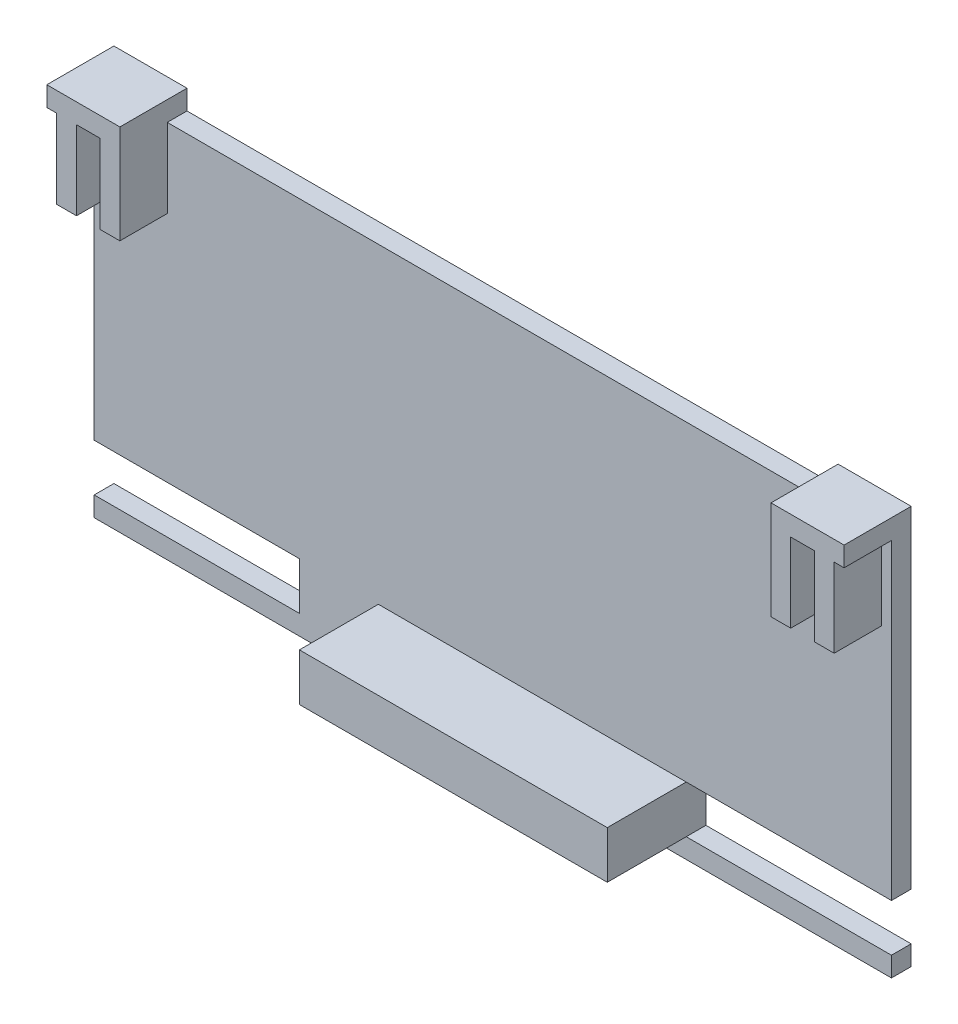
ISO-10303-21;
HEADER;
FILE_DESCRIPTION(('STEP AP214'),'2;1');
FILE_NAME('part.step','',(''),(''),'','','');
FILE_SCHEMA(('AUTOMOTIVE_DESIGN { 1 0 10303 214 1 1 1 1 }'));
ENDSEC;
DATA;
#1=APPLICATION_CONTEXT('core data for automotive mechanical design processes');
#2=APPLICATION_PROTOCOL_DEFINITION('international standard','automotive_design',2000,#1);
#3=PRODUCT_CONTEXT('',#1,'mechanical');
#4=PRODUCT('Part','Part','',(#3));
#5=PRODUCT_RELATED_PRODUCT_CATEGORY('part','',(#4));
#6=PRODUCT_DEFINITION_FORMATION('','',#4);
#7=PRODUCT_DEFINITION_CONTEXT('part definition',#1,'design');
#8=PRODUCT_DEFINITION('design','',#6,#7);
#9=PRODUCT_DEFINITION_SHAPE('','',#8);
#10=(LENGTH_UNIT() NAMED_UNIT(*) SI_UNIT(.MILLI.,.METRE.));
#11=(NAMED_UNIT(*) PLANE_ANGLE_UNIT() SI_UNIT($,.RADIAN.));
#12=(NAMED_UNIT(*) SI_UNIT($,.STERADIAN.) SOLID_ANGLE_UNIT());
#13=UNCERTAINTY_MEASURE_WITH_UNIT(LENGTH_MEASURE(1.E-05),#10,'distance_accuracy_value','');
#14=(GEOMETRIC_REPRESENTATION_CONTEXT(3) GLOBAL_UNCERTAINTY_ASSIGNED_CONTEXT((#13)) GLOBAL_UNIT_ASSIGNED_CONTEXT((#10,
#11,#12)) REPRESENTATION_CONTEXT('',''));
#15=CARTESIAN_POINT('',(0.,0.,0.));
#16=DIRECTION('',(0.,0.,1.));
#17=DIRECTION('',(1.,0.,0.));
#18=AXIS2_PLACEMENT_3D('',#15,#16,#17);
#19=CARTESIAN_POINT('',(0.,0.,1.25));
#20=DIRECTION('',(0.,0.,1.));
#21=DIRECTION('',(1.,0.,0.));
#22=AXIS2_PLACEMENT_3D('',#19,#20,#21);
#23=PLANE('',#22);
#24=DIRECTION('',(-1.,0.,0.));
#25=VECTOR('',#24,1.);
#26=CARTESIAN_POINT('',(49.25,1.25,1.25));
#27=LINE('',#26,#25);
#28=CARTESIAN_POINT('',(49.25,1.25,1.25));
#29=VERTEX_POINT('',#28);
#30=CARTESIAN_POINT('',(36.25,1.25,1.25));
#31=VERTEX_POINT('',#30);
#32=EDGE_CURVE('E374',#29,#31,#27,.T.);
#33=ORIENTED_EDGE('',*,*,#32,.T.);
#34=DIRECTION('',(1.,0.,0.));
#35=VECTOR('',#34,1.);
#36=CARTESIAN_POINT('',(16.75,1.25,1.25));
#37=LINE('',#36,#35);
#38=CARTESIAN_POINT('',(16.75,1.25,1.25));
#39=VERTEX_POINT('',#38);
#40=EDGE_CURVE('E50',#39,#31,#37,.T.);
#41=ORIENTED_EDGE('',*,*,#40,.F.);
#42=DIRECTION('',(0.,-1.,0.));
#43=VECTOR('',#42,1.);
#44=CARTESIAN_POINT('',(16.75,1.25,1.25));
#45=LINE('',#44,#43);
#46=CARTESIAN_POINT('',(16.75,4.25,1.25));
#47=VERTEX_POINT('',#46);
#48=EDGE_CURVE('E55',#47,#39,#45,.T.);
#49=ORIENTED_EDGE('',*,*,#48,.F.);
#50=DIRECTION('',(-1.,0.,0.));
#51=VECTOR('',#50,1.);
#52=CARTESIAN_POINT('',(16.75,4.25,1.25));
#53=LINE('',#52,#51);
#54=CARTESIAN_POINT('',(36.25,4.25,1.25));
#55=VERTEX_POINT('',#54);
#56=EDGE_CURVE('E281',#55,#47,#53,.T.);
#57=ORIENTED_EDGE('',*,*,#56,.F.);
#58=DIRECTION('',(1.,0.,0.));
#59=VECTOR('',#58,1.);
#60=CARTESIAN_POINT('',(49.25,4.25,1.25));
#61=LINE('',#60,#59);
#62=CARTESIAN_POINT('',(49.25,4.25,1.25));
#63=VERTEX_POINT('',#62);
#64=EDGE_CURVE('E381',#55,#63,#61,.T.);
#65=ORIENTED_EDGE('',*,*,#64,.T.);
#66=DIRECTION('',(0.,1.,0.));
#67=VECTOR('',#66,1.);
#68=CARTESIAN_POINT('',(49.25,0.,1.25));
#69=LINE('',#68,#67);
#70=CARTESIAN_POINT('',(49.25,24.,1.25));
#71=VERTEX_POINT('',#70);
#72=EDGE_CURVE('E540',#63,#71,#69,.T.);
#73=ORIENTED_EDGE('',*,*,#72,.T.);
#74=DIRECTION('',(-1.,0.,0.));
#75=VECTOR('',#74,1.);
#76=CARTESIAN_POINT('',(-1.25,24.,1.25));
#77=LINE('',#76,#75);
#78=CARTESIAN_POINT('',(48.6214635015819,24.,1.25));
#79=VERTEX_POINT('',#78);
#80=EDGE_CURVE('E515',#71,#79,#77,.T.);
#81=ORIENTED_EDGE('',*,*,#80,.T.);
#82=DIRECTION('',(0.,1.,0.));
#83=VECTOR('',#82,1.);
#84=CARTESIAN_POINT('',(48.6214635015819,19.,1.25));
#85=LINE('',#84,#83);
#86=CARTESIAN_POINT('',(48.6214635015819,19.,1.25));
#87=VERTEX_POINT('',#86);
#88=EDGE_CURVE('E484',#87,#79,#85,.T.);
#89=ORIENTED_EDGE('',*,*,#88,.F.);
#90=DIRECTION('',(-1.,0.,0.));
#91=VECTOR('',#90,1.);
#92=CARTESIAN_POINT('',(47.3714635015819,19.,1.25));
#93=LINE('',#92,#91);
#94=CARTESIAN_POINT('',(47.3714635015819,19.,1.25));
#95=VERTEX_POINT('',#94);
#96=EDGE_CURVE('E470',#87,#95,#93,.T.);
#97=ORIENTED_EDGE('',*,*,#96,.T.);
#98=DIRECTION('',(0.,1.,0.));
#99=VECTOR('',#98,1.);
#100=CARTESIAN_POINT('',(47.3714635015819,19.,1.25));
#101=LINE('',#100,#99);
#102=CARTESIAN_POINT('',(47.3714635015819,24.,1.25));
#103=VERTEX_POINT('',#102);
#104=EDGE_CURVE('E479',#95,#103,#101,.T.);
#105=ORIENTED_EDGE('',*,*,#104,.T.);
#106=CARTESIAN_POINT('',(45.8714635015819,24.,1.25));
#107=VERTEX_POINT('',#106);
#108=EDGE_CURVE('E500',#103,#107,#77,.T.);
#109=ORIENTED_EDGE('',*,*,#108,.T.);
#110=DIRECTION('',(0.,1.,0.));
#111=VECTOR('',#110,1.);
#112=CARTESIAN_POINT('',(45.8714635015819,19.,1.25));
#113=LINE('',#112,#111);
#114=CARTESIAN_POINT('',(45.8714635015819,19.,1.25));
#115=VERTEX_POINT('',#114);
#116=EDGE_CURVE('E454',#115,#107,#113,.T.);
#117=ORIENTED_EDGE('',*,*,#116,.F.);
#118=DIRECTION('',(-1.,0.,0.));
#119=VECTOR('',#118,1.);
#120=CARTESIAN_POINT('',(45.8714635015819,19.,1.25));
#121=LINE('',#120,#119);
#122=CARTESIAN_POINT('',(44.6214635015819,19.,1.25));
#123=VERTEX_POINT('',#122);
#124=EDGE_CURVE('E446',#115,#123,#121,.T.);
#125=ORIENTED_EDGE('',*,*,#124,.T.);
#126=DIRECTION('',(0.,1.,0.));
#127=VECTOR('',#126,1.);
#128=CARTESIAN_POINT('',(44.6214635015819,19.,1.25));
#129=LINE('',#128,#127);
#130=CARTESIAN_POINT('',(44.6214635015819,24.,1.25));
#131=VERTEX_POINT('',#130);
#132=EDGE_CURVE('E458',#123,#131,#129,.T.);
#133=ORIENTED_EDGE('',*,*,#132,.T.);
#134=CARTESIAN_POINT('',(3.37853649841815,24.,1.25));
#135=VERTEX_POINT('',#134);
#136=EDGE_CURVE('E496',#131,#135,#77,.T.);
#137=ORIENTED_EDGE('',*,*,#136,.T.);
#138=DIRECTION('',(0.,1.,0.));
#139=VECTOR('',#138,1.);
#140=CARTESIAN_POINT('',(3.37853649841815,19.,1.25));
#141=LINE('',#140,#139);
#142=CARTESIAN_POINT('',(3.37853649841815,19.,1.25));
#143=VERTEX_POINT('',#142);
#144=EDGE_CURVE('E434',#143,#135,#141,.T.);
#145=ORIENTED_EDGE('',*,*,#144,.F.);
#146=DIRECTION('',(-1.,0.,0.));
#147=VECTOR('',#146,1.);
#148=CARTESIAN_POINT('',(2.12853649841815,19.,1.25));
#149=LINE('',#148,#147);
#150=CARTESIAN_POINT('',(2.12853649841815,19.,1.25));
#151=VERTEX_POINT('',#150);
#152=EDGE_CURVE('E420',#143,#151,#149,.T.);
#153=ORIENTED_EDGE('',*,*,#152,.T.);
#154=DIRECTION('',(0.,1.,0.));
#155=VECTOR('',#154,1.);
#156=CARTESIAN_POINT('',(2.12853649841815,19.,1.25));
#157=LINE('',#156,#155);
#158=CARTESIAN_POINT('',(2.12853649841815,24.,1.25));
#159=VERTEX_POINT('',#158);
#160=EDGE_CURVE('E431',#151,#159,#157,.T.);
#161=ORIENTED_EDGE('',*,*,#160,.T.);
#162=CARTESIAN_POINT('',(0.628536498418146,24.,1.25));
#163=VERTEX_POINT('',#162);
#164=EDGE_CURVE('E501',#159,#163,#77,.T.);
#165=ORIENTED_EDGE('',*,*,#164,.T.);
#166=DIRECTION('',(0.,1.,0.));
#167=VECTOR('',#166,1.);
#168=CARTESIAN_POINT('',(0.628536498418146,19.,1.25));
#169=LINE('',#168,#167);
#170=CARTESIAN_POINT('',(0.628536498418146,19.,1.25));
#171=VERTEX_POINT('',#170);
#172=EDGE_CURVE('E411',#171,#163,#169,.T.);
#173=ORIENTED_EDGE('',*,*,#172,.F.);
#174=DIRECTION('',(-1.,0.,0.));
#175=VECTOR('',#174,1.);
#176=CARTESIAN_POINT('',(0.628536498418146,19.,1.25));
#177=LINE('',#176,#175);
#178=CARTESIAN_POINT('',(-0.621463501581855,19.,1.25));
#179=VERTEX_POINT('',#178);
#180=EDGE_CURVE('E394',#171,#179,#177,.T.);
#181=ORIENTED_EDGE('',*,*,#180,.T.);
#182=DIRECTION('',(0.,1.,0.));
#183=VECTOR('',#182,1.);
#184=CARTESIAN_POINT('',(-0.621463501581855,19.,1.25));
#185=LINE('',#184,#183);
#186=CARTESIAN_POINT('',(-0.621463501581855,24.,1.25));
#187=VERTEX_POINT('',#186);
#188=EDGE_CURVE('E406',#179,#187,#185,.T.);
#189=ORIENTED_EDGE('',*,*,#188,.T.);
#190=CARTESIAN_POINT('',(-1.25,24.,1.25));
#191=VERTEX_POINT('',#190);
#192=EDGE_CURVE('E531',#187,#191,#77,.T.);
#193=ORIENTED_EDGE('',*,*,#192,.T.);
#194=DIRECTION('',(0.,-1.,0.));
#195=VECTOR('',#194,1.);
#196=CARTESIAN_POINT('',(-1.25,0.,1.25));
#197=LINE('',#196,#195);
#198=CARTESIAN_POINT('',(-1.25,4.25,1.25));
#199=VERTEX_POINT('',#198);
#200=EDGE_CURVE('E507',#191,#199,#197,.T.);
#201=ORIENTED_EDGE('',*,*,#200,.T.);
#202=DIRECTION('',(1.,0.,0.));
#203=VECTOR('',#202,1.);
#204=CARTESIAN_POINT('',(-1.25,4.25,1.25));
#205=LINE('',#204,#203);
#206=CARTESIAN_POINT('',(11.75,4.25,1.25));
#207=VERTEX_POINT('',#206);
#208=EDGE_CURVE('E362',#199,#207,#205,.T.);
#209=ORIENTED_EDGE('',*,*,#208,.T.);
#210=DIRECTION('',(0.,-1.,0.));
#211=VECTOR('',#210,1.);
#212=CARTESIAN_POINT('',(11.75,1.25,1.25));
#213=LINE('',#212,#211);
#214=CARTESIAN_POINT('',(11.75,1.25,1.25));
#215=VERTEX_POINT('',#214);
#216=EDGE_CURVE('E358',#207,#215,#213,.T.);
#217=ORIENTED_EDGE('',*,*,#216,.T.);
#218=DIRECTION('',(-1.,0.,0.));
#219=VECTOR('',#218,1.);
#220=CARTESIAN_POINT('',(-1.25,1.25,1.25));
#221=LINE('',#220,#219);
#222=CARTESIAN_POINT('',(-1.25,1.25,1.25));
#223=VERTEX_POINT('',#222);
#224=EDGE_CURVE('E353',#215,#223,#221,.T.);
#225=ORIENTED_EDGE('',*,*,#224,.T.);
#226=CARTESIAN_POINT('',(-1.25,0.,1.25));
#227=VERTEX_POINT('',#226);
#228=EDGE_CURVE('E517',#223,#227,#197,.T.);
#229=ORIENTED_EDGE('',*,*,#228,.T.);
#230=DIRECTION('',(1.,0.,0.));
#231=VECTOR('',#230,1.);
#232=CARTESIAN_POINT('',(-1.25,0.,1.25));
#233=LINE('',#232,#231);
#234=CARTESIAN_POINT('',(49.25,0.,1.25));
#235=VERTEX_POINT('',#234);
#236=EDGE_CURVE('E476',#227,#235,#233,.T.);
#237=ORIENTED_EDGE('',*,*,#236,.T.);
#238=EDGE_CURVE('E505',#235,#29,#69,.T.);
#239=ORIENTED_EDGE('',*,*,#238,.T.);
#240=EDGE_LOOP('',(#33,#41,#49,#57,#65,#73,#81,#89,#97,#105,#109,#117,#125,#133,#137,#145,#153,
#161,#165,#173,#181,#189,#193,#201,#209,#217,#225,#229,#237,#239));
#241=FACE_BOUND('',#240,.T.);
#242=ADVANCED_FACE('F33',(#241),#23,.T.);
#243=CARTESIAN_POINT('',(-1.25,24.,1.25));
#244=DIRECTION('',(0.,-1.,0.));
#245=DIRECTION('',(0.,0.,-1.));
#246=AXIS2_PLACEMENT_3D('',#243,#244,#245);
#247=PLANE('',#246);
#248=DIRECTION('',(0.,0.,-1.));
#249=VECTOR('',#248,1.);
#250=CARTESIAN_POINT('',(3.37853649841815,24.,4.25));
#251=LINE('',#250,#249);
#252=CARTESIAN_POINT('',(3.37853649841815,24.,0.));
#253=VERTEX_POINT('',#252);
#254=EDGE_CURVE('E284',#135,#253,#251,.T.);
#255=ORIENTED_EDGE('',*,*,#254,.F.);
#256=ORIENTED_EDGE('',*,*,#136,.F.);
#257=DIRECTION('',(0.,0.,1.));
#258=VECTOR('',#257,1.);
#259=CARTESIAN_POINT('',(44.6214635015819,24.,4.25));
#260=LINE('',#259,#258);
#261=CARTESIAN_POINT('',(44.6214635015819,24.,0.));
#262=VERTEX_POINT('',#261);
#263=EDGE_CURVE('E315',#262,#131,#260,.T.);
#264=ORIENTED_EDGE('',*,*,#263,.F.);
#265=DIRECTION('',(-1.,0.,0.));
#266=VECTOR('',#265,1.);
#267=CARTESIAN_POINT('',(-1.25,24.,0.));
#268=LINE('',#267,#266);
#269=EDGE_CURVE('E529',#262,#253,#268,.T.);
#270=ORIENTED_EDGE('',*,*,#269,.T.);
#271=EDGE_LOOP('',(#255,#256,#264,#270));
#272=FACE_BOUND('',#271,.T.);
#273=ADVANCED_FACE('F639',(#272),#247,.F.);
#274=CARTESIAN_POINT('',(-1.25,0.,1.25));
#275=DIRECTION('',(1.,0.,0.));
#276=DIRECTION('',(0.,0.,-1.));
#277=AXIS2_PLACEMENT_3D('',#274,#275,#276);
#278=PLANE('',#277);
#279=DIRECTION('',(0.,-1.,0.));
#280=VECTOR('',#279,1.);
#281=CARTESIAN_POINT('',(-1.25,0.,0.));
#282=LINE('',#281,#280);
#283=CARTESIAN_POINT('',(-1.25,25.25,0.));
#284=VERTEX_POINT('',#283);
#285=CARTESIAN_POINT('',(-1.25,4.25,0.));
#286=VERTEX_POINT('',#285);
#287=EDGE_CURVE('E521',#284,#286,#282,.T.);
#288=ORIENTED_EDGE('',*,*,#287,.T.);
#289=DIRECTION('',(0.,0.,-1.));
#290=VECTOR('',#289,1.);
#291=CARTESIAN_POINT('',(-1.25,4.25,14.5916640641263));
#292=LINE('',#291,#290);
#293=EDGE_CURVE('E347',#199,#286,#292,.T.);
#294=ORIENTED_EDGE('',*,*,#293,.F.);
#295=ORIENTED_EDGE('',*,*,#200,.F.);
#296=DIRECTION('',(0.,0.,1.));
#297=VECTOR('',#296,1.);
#298=CARTESIAN_POINT('',(-1.25,24.,4.25));
#299=LINE('',#298,#297);
#300=CARTESIAN_POINT('',(-1.25,24.,4.25));
#301=VERTEX_POINT('',#300);
#302=EDGE_CURVE('E287',#191,#301,#299,.T.);
#303=ORIENTED_EDGE('',*,*,#302,.T.);
#304=DIRECTION('',(0.,-1.,0.));
#305=VECTOR('',#304,1.);
#306=CARTESIAN_POINT('',(-1.25,25.25,4.25));
#307=LINE('',#306,#305);
#308=CARTESIAN_POINT('',(-1.25,25.25,4.25));
#309=VERTEX_POINT('',#308);
#310=EDGE_CURVE('E304',#309,#301,#307,.T.);
#311=ORIENTED_EDGE('',*,*,#310,.F.);
#312=DIRECTION('',(0.,0.,1.));
#313=VECTOR('',#312,1.);
#314=CARTESIAN_POINT('',(-1.25,25.25,4.25));
#315=LINE('',#314,#313);
#316=EDGE_CURVE('E300',#284,#309,#315,.T.);
#317=ORIENTED_EDGE('',*,*,#316,.F.);
#318=EDGE_LOOP('',(#288,#294,#295,#303,#311,#317));
#319=FACE_BOUND('',#318,.T.);
#320=ADVANCED_FACE('F646',(#319),#278,.F.);
#321=CARTESIAN_POINT('',(49.25,0.,1.25));
#322=DIRECTION('',(-1.,0.,0.));
#323=DIRECTION('',(0.,0.,1.));
#324=AXIS2_PLACEMENT_3D('',#321,#322,#323);
#325=PLANE('',#324);
#326=DIRECTION('',(0.,1.,0.));
#327=VECTOR('',#326,1.);
#328=CARTESIAN_POINT('',(49.25,0.,0.));
#329=LINE('',#328,#327);
#330=CARTESIAN_POINT('',(49.25,0.,0.));
#331=VERTEX_POINT('',#330);
#332=CARTESIAN_POINT('',(49.25,1.25,0.));
#333=VERTEX_POINT('',#332);
#334=EDGE_CURVE('E527',#331,#333,#329,.T.);
#335=ORIENTED_EDGE('',*,*,#334,.T.);
#336=DIRECTION('',(0.,0.,-1.));
#337=VECTOR('',#336,1.);
#338=CARTESIAN_POINT('',(49.25,1.25,14.5916640641263));
#339=LINE('',#338,#337);
#340=EDGE_CURVE('E388',#29,#333,#339,.T.);
#341=ORIENTED_EDGE('',*,*,#340,.F.);
#342=ORIENTED_EDGE('',*,*,#238,.F.);
#343=DIRECTION('',(0.,0.,-1.));
#344=VECTOR('',#343,1.);
#345=CARTESIAN_POINT('',(49.25,0.,1.25));
#346=LINE('',#345,#344);
#347=EDGE_CURVE('E11',#235,#331,#346,.T.);
#348=ORIENTED_EDGE('',*,*,#347,.T.);
#349=EDGE_LOOP('',(#335,#341,#342,#348));
#350=FACE_BOUND('',#349,.T.);
#351=ADVANCED_FACE('F601',(#350),#325,.F.);
#352=CARTESIAN_POINT('',(-1.25,0.,1.25));
#353=DIRECTION('',(0.,1.,0.));
#354=DIRECTION('',(-1.,0.,0.));
#355=AXIS2_PLACEMENT_3D('',#352,#353,#354);
#356=PLANE('',#355);
#357=DIRECTION('',(1.,0.,0.));
#358=VECTOR('',#357,1.);
#359=CARTESIAN_POINT('',(-1.25,0.,0.));
#360=LINE('',#359,#358);
#361=CARTESIAN_POINT('',(-1.25,0.,0.));
#362=VERTEX_POINT('',#361);
#363=EDGE_CURVE('E483',#362,#331,#360,.T.);
#364=ORIENTED_EDGE('',*,*,#363,.T.);
#365=ORIENTED_EDGE('',*,*,#347,.F.);
#366=ORIENTED_EDGE('',*,*,#236,.F.);
#367=DIRECTION('',(0.,0.,-1.));
#368=VECTOR('',#367,1.);
#369=CARTESIAN_POINT('',(-1.25,0.,1.25));
#370=LINE('',#369,#368);
#371=EDGE_CURVE('E42',#227,#362,#370,.T.);
#372=ORIENTED_EDGE('',*,*,#371,.T.);
#373=EDGE_LOOP('',(#364,#365,#366,#372));
#374=FACE_BOUND('',#373,.T.);
#375=ADVANCED_FACE('F35',(#374),#356,.F.);
#376=ORIENTED_EDGE('',*,*,#72,.F.);
#377=DIRECTION('',(0.,0.,-1.));
#378=VECTOR('',#377,1.);
#379=CARTESIAN_POINT('',(49.25,4.25,14.5916640641263));
#380=LINE('',#379,#378);
#381=CARTESIAN_POINT('',(49.25,4.25,0.));
#382=VERTEX_POINT('',#381);
#383=EDGE_CURVE('E384',#63,#382,#380,.T.);
#384=ORIENTED_EDGE('',*,*,#383,.T.);
#385=CARTESIAN_POINT('',(49.25,25.25,0.));
#386=VERTEX_POINT('',#385);
#387=EDGE_CURVE('E686',#382,#386,#329,.T.);
#388=ORIENTED_EDGE('',*,*,#387,.T.);
#389=DIRECTION('',(0.,0.,-1.));
#390=VECTOR('',#389,1.);
#391=CARTESIAN_POINT('',(49.25,25.25,4.25));
#392=LINE('',#391,#390);
#393=CARTESIAN_POINT('',(49.25,25.25,4.25));
#394=VERTEX_POINT('',#393);
#395=EDGE_CURVE('E322',#394,#386,#392,.T.);
#396=ORIENTED_EDGE('',*,*,#395,.F.);
#397=DIRECTION('',(0.,-1.,0.));
#398=VECTOR('',#397,1.);
#399=CARTESIAN_POINT('',(49.25,25.25,4.25));
#400=LINE('',#399,#398);
#401=CARTESIAN_POINT('',(49.25,24.,4.25));
#402=VERTEX_POINT('',#401);
#403=EDGE_CURVE('E337',#394,#402,#400,.T.);
#404=ORIENTED_EDGE('',*,*,#403,.T.);
#405=DIRECTION('',(0.,0.,-1.));
#406=VECTOR('',#405,1.);
#407=CARTESIAN_POINT('',(49.25,24.,4.25));
#408=LINE('',#407,#406);
#409=EDGE_CURVE('E320',#402,#71,#408,.T.);
#410=ORIENTED_EDGE('',*,*,#409,.T.);
#411=EDGE_LOOP('',(#376,#384,#388,#396,#404,#410));
#412=FACE_BOUND('',#411,.T.);
#413=ADVANCED_FACE('F656',(#412),#325,.F.);
#414=ORIENTED_EDGE('',*,*,#228,.F.);
#415=DIRECTION('',(0.,0.,-1.));
#416=VECTOR('',#415,1.);
#417=CARTESIAN_POINT('',(-1.25,1.25,14.5916640641263));
#418=LINE('',#417,#416);
#419=CARTESIAN_POINT('',(-1.25,1.25,0.));
#420=VERTEX_POINT('',#419);
#421=EDGE_CURVE('E356',#223,#420,#418,.T.);
#422=ORIENTED_EDGE('',*,*,#421,.T.);
#423=EDGE_CURVE('E524',#420,#362,#282,.T.);
#424=ORIENTED_EDGE('',*,*,#423,.T.);
#425=ORIENTED_EDGE('',*,*,#371,.F.);
#426=EDGE_LOOP('',(#414,#422,#424,#425));
#427=FACE_BOUND('',#426,.T.);
#428=ADVANCED_FACE('F654',(#427),#278,.F.);
#429=CARTESIAN_POINT('',(0.,0.,0.));
#430=DIRECTION('',(0.,0.,1.));
#431=DIRECTION('',(1.,0.,0.));
#432=AXIS2_PLACEMENT_3D('',#429,#430,#431);
#433=PLANE('',#432);
#434=DIRECTION('',(0.,-1.,0.));
#435=VECTOR('',#434,1.);
#436=CARTESIAN_POINT('',(11.75,1.25,0.));
#437=LINE('',#436,#435);
#438=CARTESIAN_POINT('',(11.75,4.25,0.));
#439=VERTEX_POINT('',#438);
#440=CARTESIAN_POINT('',(11.75,1.25,0.));
#441=VERTEX_POINT('',#440);
#442=EDGE_CURVE('E345',#439,#441,#437,.T.);
#443=ORIENTED_EDGE('',*,*,#442,.F.);
#444=DIRECTION('',(1.,0.,0.));
#445=VECTOR('',#444,1.);
#446=CARTESIAN_POINT('',(-1.25,4.25,0.));
#447=LINE('',#446,#445);
#448=EDGE_CURVE('E348',#286,#439,#447,.T.);
#449=ORIENTED_EDGE('',*,*,#448,.F.);
#450=ORIENTED_EDGE('',*,*,#287,.F.);
#451=DIRECTION('',(-1.,0.,0.));
#452=VECTOR('',#451,1.);
#453=CARTESIAN_POINT('',(3.37853649841815,25.25,0.));
#454=LINE('',#453,#452);
#455=CARTESIAN_POINT('',(3.37853649841815,25.25,0.));
#456=VERTEX_POINT('',#455);
#457=EDGE_CURVE('E296',#456,#284,#454,.T.);
#458=ORIENTED_EDGE('',*,*,#457,.F.);
#459=DIRECTION('',(0.,-1.,0.));
#460=VECTOR('',#459,1.);
#461=CARTESIAN_POINT('',(3.37853649841815,25.25,0.));
#462=LINE('',#461,#460);
#463=EDGE_CURVE('E312',#456,#253,#462,.T.);
#464=ORIENTED_EDGE('',*,*,#463,.T.);
#465=ORIENTED_EDGE('',*,*,#269,.F.);
#466=DIRECTION('',(0.,-1.,0.));
#467=VECTOR('',#466,1.);
#468=CARTESIAN_POINT('',(44.6214635015819,25.25,0.));
#469=LINE('',#468,#467);
#470=CARTESIAN_POINT('',(44.6214635015819,25.25,0.));
#471=VERTEX_POINT('',#470);
#472=EDGE_CURVE('E327',#471,#262,#469,.T.);
#473=ORIENTED_EDGE('',*,*,#472,.F.);
#474=DIRECTION('',(-1.,0.,0.));
#475=VECTOR('',#474,1.);
#476=CARTESIAN_POINT('',(44.6214635015819,25.25,0.));
#477=LINE('',#476,#475);
#478=EDGE_CURVE('E325',#386,#471,#477,.T.);
#479=ORIENTED_EDGE('',*,*,#478,.F.);
#480=ORIENTED_EDGE('',*,*,#387,.F.);
#481=DIRECTION('',(1.,0.,0.));
#482=VECTOR('',#481,1.);
#483=CARTESIAN_POINT('',(49.25,4.25,0.));
#484=LINE('',#483,#482);
#485=CARTESIAN_POINT('',(36.25,4.25,0.));
#486=VERTEX_POINT('',#485);
#487=EDGE_CURVE('E372',#486,#382,#484,.T.);
#488=ORIENTED_EDGE('',*,*,#487,.F.);
#489=DIRECTION('',(0.,1.,0.));
#490=VECTOR('',#489,1.);
#491=CARTESIAN_POINT('',(36.25,1.25,0.));
#492=LINE('',#491,#490);
#493=CARTESIAN_POINT('',(36.25,1.25,0.));
#494=VERTEX_POINT('',#493);
#495=EDGE_CURVE('E375',#494,#486,#492,.T.);
#496=ORIENTED_EDGE('',*,*,#495,.F.);
#497=DIRECTION('',(-1.,0.,0.));
#498=VECTOR('',#497,1.);
#499=CARTESIAN_POINT('',(49.25,1.25,0.));
#500=LINE('',#499,#498);
#501=EDGE_CURVE('E371',#333,#494,#500,.T.);
#502=ORIENTED_EDGE('',*,*,#501,.F.);
#503=ORIENTED_EDGE('',*,*,#334,.F.);
#504=ORIENTED_EDGE('',*,*,#363,.F.);
#505=ORIENTED_EDGE('',*,*,#423,.F.);
#506=DIRECTION('',(-1.,0.,0.));
#507=VECTOR('',#506,1.);
#508=CARTESIAN_POINT('',(-1.25,1.25,0.));
#509=LINE('',#508,#507);
#510=EDGE_CURVE('E351',#441,#420,#509,.T.);
#511=ORIENTED_EDGE('',*,*,#510,.F.);
#512=EDGE_LOOP('',(#443,#449,#450,#458,#464,#465,#473,#479,#480,#488,#496,#502,#503,#504,#505,#511));
#513=FACE_BOUND('',#512,.T.);
#514=ADVANCED_FACE('F609',(#513),#433,.F.);
#515=CARTESIAN_POINT('',(47.3714635015819,19.,1.25));
#516=DIRECTION('',(-1.,0.,0.));
#517=DIRECTION('',(0.,-1.,0.));
#518=AXIS2_PLACEMENT_3D('',#515,#516,#517);
#519=PLANE('',#518);
#520=DIRECTION('',(0.,0.,1.));
#521=VECTOR('',#520,1.);
#522=CARTESIAN_POINT('',(47.3714635015819,24.,1.25));
#523=LINE('',#522,#521);
#524=CARTESIAN_POINT('',(47.3714635015819,24.,4.25));
#525=VERTEX_POINT('',#524);
#526=EDGE_CURVE('E493',#103,#525,#523,.T.);
#527=ORIENTED_EDGE('',*,*,#526,.F.);
#528=ORIENTED_EDGE('',*,*,#104,.F.);
#529=DIRECTION('',(0.,0.,1.));
#530=VECTOR('',#529,1.);
#531=CARTESIAN_POINT('',(47.3714635015819,19.,1.25));
#532=LINE('',#531,#530);
#533=CARTESIAN_POINT('',(47.3714635015819,19.,4.25));
#534=VERTEX_POINT('',#533);
#535=EDGE_CURVE('E461',#95,#534,#532,.T.);
#536=ORIENTED_EDGE('',*,*,#535,.T.);
#537=DIRECTION('',(0.,1.,0.));
#538=VECTOR('',#537,1.);
#539=CARTESIAN_POINT('',(47.3714635015819,19.,4.25));
#540=LINE('',#539,#538);
#541=EDGE_CURVE('E473',#534,#525,#540,.T.);
#542=ORIENTED_EDGE('',*,*,#541,.T.);
#543=EDGE_LOOP('',(#527,#528,#536,#542));
#544=FACE_BOUND('',#543,.T.);
#545=ADVANCED_FACE('F650',(#544),#519,.T.);
#546=CARTESIAN_POINT('',(48.6214635015819,19.,1.25));
#547=DIRECTION('',(1.,0.,0.));
#548=DIRECTION('',(0.,1.,0.));
#549=AXIS2_PLACEMENT_3D('',#546,#547,#548);
#550=PLANE('',#549);
#551=DIRECTION('',(0.,0.,-1.));
#552=VECTOR('',#551,1.);
#553=CARTESIAN_POINT('',(48.6214635015819,24.,1.25));
#554=LINE('',#553,#552);
#555=CARTESIAN_POINT('',(48.6214635015819,24.,4.25));
#556=VERTEX_POINT('',#555);
#557=EDGE_CURVE('E465',#556,#79,#554,.T.);
#558=ORIENTED_EDGE('',*,*,#557,.F.);
#559=DIRECTION('',(0.,1.,0.));
#560=VECTOR('',#559,1.);
#561=CARTESIAN_POINT('',(48.6214635015819,19.,4.25));
#562=LINE('',#561,#560);
#563=CARTESIAN_POINT('',(48.6214635015819,19.,4.25));
#564=VERTEX_POINT('',#563);
#565=EDGE_CURVE('E488',#564,#556,#562,.T.);
#566=ORIENTED_EDGE('',*,*,#565,.F.);
#567=DIRECTION('',(0.,0.,-1.));
#568=VECTOR('',#567,1.);
#569=CARTESIAN_POINT('',(48.6214635015819,19.,1.25));
#570=LINE('',#569,#568);
#571=EDGE_CURVE('E468',#564,#87,#570,.T.);
#572=ORIENTED_EDGE('',*,*,#571,.T.);
#573=ORIENTED_EDGE('',*,*,#88,.T.);
#574=EDGE_LOOP('',(#558,#566,#572,#573));
#575=FACE_BOUND('',#574,.T.);
#576=ADVANCED_FACE('F745',(#575),#550,.T.);
#577=CARTESIAN_POINT('',(47.3714635015819,19.,4.25));
#578=DIRECTION('',(0.,0.,1.));
#579=DIRECTION('',(1.,0.,0.));
#580=AXIS2_PLACEMENT_3D('',#577,#578,#579);
#581=PLANE('',#580);
#582=ORIENTED_EDGE('',*,*,#565,.T.);
#583=DIRECTION('',(1.,0.,0.));
#584=VECTOR('',#583,1.);
#585=CARTESIAN_POINT('',(44.6214635015819,24.,4.25));
#586=LINE('',#585,#584);
#587=EDGE_CURVE('E336',#556,#402,#586,.T.);
#588=ORIENTED_EDGE('',*,*,#587,.T.);
#589=ORIENTED_EDGE('',*,*,#403,.F.);
#590=DIRECTION('',(1.,0.,0.));
#591=VECTOR('',#590,1.);
#592=CARTESIAN_POINT('',(44.6214635015819,25.25,4.25));
#593=LINE('',#592,#591);
#594=CARTESIAN_POINT('',(44.6214635015819,25.25,4.25));
#595=VERTEX_POINT('',#594);
#596=EDGE_CURVE('E319',#595,#394,#593,.T.);
#597=ORIENTED_EDGE('',*,*,#596,.F.);
#598=DIRECTION('',(0.,1.,0.));
#599=VECTOR('',#598,1.);
#600=CARTESIAN_POINT('',(44.6214635015819,19.,4.25));
#601=LINE('',#600,#599);
#602=CARTESIAN_POINT('',(44.6214635015819,19.,4.25));
#603=VERTEX_POINT('',#602);
#604=EDGE_CURVE('E455',#603,#595,#601,.T.);
#605=ORIENTED_EDGE('',*,*,#604,.F.);
#606=DIRECTION('',(1.,0.,0.));
#607=VECTOR('',#606,1.);
#608=CARTESIAN_POINT('',(45.8714635015819,19.,4.25));
#609=LINE('',#608,#607);
#610=CARTESIAN_POINT('',(45.8714635015819,19.,4.25));
#611=VERTEX_POINT('',#610);
#612=EDGE_CURVE('E451',#603,#611,#609,.T.);
#613=ORIENTED_EDGE('',*,*,#612,.T.);
#614=DIRECTION('',(0.,1.,0.));
#615=VECTOR('',#614,1.);
#616=CARTESIAN_POINT('',(45.8714635015819,19.,4.25));
#617=LINE('',#616,#615);
#618=CARTESIAN_POINT('',(45.8714635015819,24.,4.25));
#619=VERTEX_POINT('',#618);
#620=EDGE_CURVE('E457',#611,#619,#617,.T.);
#621=ORIENTED_EDGE('',*,*,#620,.T.);
#622=EDGE_CURVE('E340',#619,#525,#586,.T.);
#623=ORIENTED_EDGE('',*,*,#622,.T.);
#624=ORIENTED_EDGE('',*,*,#541,.F.);
#625=DIRECTION('',(1.,0.,0.));
#626=VECTOR('',#625,1.);
#627=CARTESIAN_POINT('',(47.3714635015819,19.,4.25));
#628=LINE('',#627,#626);
#629=EDGE_CURVE('E464',#534,#564,#628,.T.);
#630=ORIENTED_EDGE('',*,*,#629,.T.);
#631=EDGE_LOOP('',(#582,#588,#589,#597,#605,#613,#621,#623,#624,#630));
#632=FACE_BOUND('',#631,.T.);
#633=ADVANCED_FACE('F743',(#632),#581,.T.);
#634=CARTESIAN_POINT('',(0.,19.,0.));
#635=DIRECTION('',(0.,1.,0.));
#636=DIRECTION('',(0.,0.,1.));
#637=AXIS2_PLACEMENT_3D('',#634,#635,#636);
#638=PLANE('',#637);
#639=ORIENTED_EDGE('',*,*,#535,.F.);
#640=ORIENTED_EDGE('',*,*,#96,.F.);
#641=ORIENTED_EDGE('',*,*,#571,.F.);
#642=ORIENTED_EDGE('',*,*,#629,.F.);
#643=EDGE_LOOP('',(#639,#640,#641,#642));
#644=FACE_BOUND('',#643,.T.);
#645=ADVANCED_FACE('F740',(#644),#638,.F.);
#646=CARTESIAN_POINT('',(45.8714635015819,19.,1.25));
#647=DIRECTION('',(1.,0.,0.));
#648=DIRECTION('',(0.,1.,0.));
#649=AXIS2_PLACEMENT_3D('',#646,#647,#648);
#650=PLANE('',#649);
#651=DIRECTION('',(0.,0.,-1.));
#652=VECTOR('',#651,1.);
#653=CARTESIAN_POINT('',(45.8714635015819,24.,1.25));
#654=LINE('',#653,#652);
#655=EDGE_CURVE('E437',#619,#107,#654,.T.);
#656=ORIENTED_EDGE('',*,*,#655,.F.);
#657=ORIENTED_EDGE('',*,*,#620,.F.);
#658=DIRECTION('',(0.,0.,-1.));
#659=VECTOR('',#658,1.);
#660=CARTESIAN_POINT('',(45.8714635015819,19.,1.25));
#661=LINE('',#660,#659);
#662=EDGE_CURVE('E443',#611,#115,#661,.T.);
#663=ORIENTED_EDGE('',*,*,#662,.T.);
#664=ORIENTED_EDGE('',*,*,#116,.T.);
#665=EDGE_LOOP('',(#656,#657,#663,#664));
#666=FACE_BOUND('',#665,.T.);
#667=ADVANCED_FACE('F558',(#666),#650,.T.);
#668=CARTESIAN_POINT('',(44.6214635015819,19.,1.25));
#669=DIRECTION('',(-1.,0.,0.));
#670=DIRECTION('',(0.,-1.,0.));
#671=AXIS2_PLACEMENT_3D('',#668,#669,#670);
#672=PLANE('',#671);
#673=ORIENTED_EDGE('',*,*,#604,.T.);
#674=DIRECTION('',(0.,0.,1.));
#675=VECTOR('',#674,1.);
#676=CARTESIAN_POINT('',(44.6214635015819,25.25,4.25));
#677=LINE('',#676,#675);
#678=EDGE_CURVE('E316',#471,#595,#677,.T.);
#679=ORIENTED_EDGE('',*,*,#678,.F.);
#680=ORIENTED_EDGE('',*,*,#472,.T.);
#681=ORIENTED_EDGE('',*,*,#263,.T.);
#682=ORIENTED_EDGE('',*,*,#132,.F.);
#683=DIRECTION('',(0.,0.,1.));
#684=VECTOR('',#683,1.);
#685=CARTESIAN_POINT('',(44.6214635015819,19.,1.25));
#686=LINE('',#685,#684);
#687=EDGE_CURVE('E448',#123,#603,#686,.T.);
#688=ORIENTED_EDGE('',*,*,#687,.T.);
#689=EDGE_LOOP('',(#673,#679,#680,#681,#682,#688));
#690=FACE_BOUND('',#689,.T.);
#691=ADVANCED_FACE('F567',(#690),#672,.T.);
#692=CARTESIAN_POINT('',(0.,19.,0.));
#693=DIRECTION('',(0.,-1.,0.));
#694=DIRECTION('',(0.,0.,-1.));
#695=AXIS2_PLACEMENT_3D('',#692,#693,#694);
#696=PLANE('',#695);
#697=ORIENTED_EDGE('',*,*,#662,.F.);
#698=ORIENTED_EDGE('',*,*,#612,.F.);
#699=ORIENTED_EDGE('',*,*,#687,.F.);
#700=ORIENTED_EDGE('',*,*,#124,.F.);
#701=EDGE_LOOP('',(#697,#698,#699,#700));
#702=FACE_BOUND('',#701,.T.);
#703=ADVANCED_FACE('F564',(#702),#696,.T.);
#704=CARTESIAN_POINT('',(3.37853649841815,19.,1.25));
#705=DIRECTION('',(1.,0.,0.));
#706=DIRECTION('',(0.,1.,0.));
#707=AXIS2_PLACEMENT_3D('',#704,#705,#706);
#708=PLANE('',#707);
#709=ORIENTED_EDGE('',*,*,#144,.T.);
#710=ORIENTED_EDGE('',*,*,#254,.T.);
#711=ORIENTED_EDGE('',*,*,#463,.F.);
#712=DIRECTION('',(0.,0.,-1.));
#713=VECTOR('',#712,1.);
#714=CARTESIAN_POINT('',(3.37853649841815,25.25,4.25));
#715=LINE('',#714,#713);
#716=CARTESIAN_POINT('',(3.37853649841815,25.25,4.25));
#717=VERTEX_POINT('',#716);
#718=EDGE_CURVE('E293',#717,#456,#715,.T.);
#719=ORIENTED_EDGE('',*,*,#718,.F.);
#720=DIRECTION('',(0.,1.,0.));
#721=VECTOR('',#720,1.);
#722=CARTESIAN_POINT('',(3.37853649841815,19.,4.25));
#723=LINE('',#722,#721);
#724=CARTESIAN_POINT('',(3.37853649841815,19.,4.25));
#725=VERTEX_POINT('',#724);
#726=EDGE_CURVE('E438',#725,#717,#723,.T.);
#727=ORIENTED_EDGE('',*,*,#726,.F.);
#728=DIRECTION('',(0.,0.,-1.));
#729=VECTOR('',#728,1.);
#730=CARTESIAN_POINT('',(3.37853649841815,19.,1.25));
#731=LINE('',#730,#729);
#732=EDGE_CURVE('E428',#725,#143,#731,.T.);
#733=ORIENTED_EDGE('',*,*,#732,.T.);
#734=EDGE_LOOP('',(#709,#710,#711,#719,#727,#733));
#735=FACE_BOUND('',#734,.T.);
#736=ADVANCED_FACE('F573',(#735),#708,.T.);
#737=CARTESIAN_POINT('',(2.12853649841815,19.,4.25));
#738=DIRECTION('',(0.,0.,1.));
#739=DIRECTION('',(1.,0.,0.));
#740=AXIS2_PLACEMENT_3D('',#737,#738,#739);
#741=PLANE('',#740);
#742=ORIENTED_EDGE('',*,*,#726,.T.);
#743=DIRECTION('',(1.,0.,0.));
#744=VECTOR('',#743,1.);
#745=CARTESIAN_POINT('',(3.37853649841815,25.25,4.25));
#746=LINE('',#745,#744);
#747=EDGE_CURVE('E302',#309,#717,#746,.T.);
#748=ORIENTED_EDGE('',*,*,#747,.F.);
#749=ORIENTED_EDGE('',*,*,#310,.T.);
#750=DIRECTION('',(1.,0.,0.));
#751=VECTOR('',#750,1.);
#752=CARTESIAN_POINT('',(3.37853649841815,24.,4.25));
#753=LINE('',#752,#751);
#754=CARTESIAN_POINT('',(-0.621463501581855,24.,4.25));
#755=VERTEX_POINT('',#754);
#756=EDGE_CURVE('E297',#301,#755,#753,.T.);
#757=ORIENTED_EDGE('',*,*,#756,.T.);
#758=DIRECTION('',(0.,1.,0.));
#759=VECTOR('',#758,1.);
#760=CARTESIAN_POINT('',(-0.621463501581855,19.,4.25));
#761=LINE('',#760,#759);
#762=CARTESIAN_POINT('',(-0.621463501581855,19.,4.25));
#763=VERTEX_POINT('',#762);
#764=EDGE_CURVE('E417',#763,#755,#761,.T.);
#765=ORIENTED_EDGE('',*,*,#764,.F.);
#766=DIRECTION('',(1.,0.,0.));
#767=VECTOR('',#766,1.);
#768=CARTESIAN_POINT('',(0.628536498418146,19.,4.25));
#769=LINE('',#768,#767);
#770=CARTESIAN_POINT('',(0.628536498418146,19.,4.25));
#771=VERTEX_POINT('',#770);
#772=EDGE_CURVE('E400',#763,#771,#769,.T.);
#773=ORIENTED_EDGE('',*,*,#772,.T.);
#774=DIRECTION('',(0.,1.,0.));
#775=VECTOR('',#774,1.);
#776=CARTESIAN_POINT('',(0.628536498418146,19.,4.25));
#777=LINE('',#776,#775);
#778=CARTESIAN_POINT('',(0.628536498418146,24.,4.25));
#779=VERTEX_POINT('',#778);
#780=EDGE_CURVE('E415',#771,#779,#777,.T.);
#781=ORIENTED_EDGE('',*,*,#780,.T.);
#782=CARTESIAN_POINT('',(2.12853649841815,24.,4.25));
#783=VERTEX_POINT('',#782);
#784=EDGE_CURVE('E307',#779,#783,#753,.T.);
#785=ORIENTED_EDGE('',*,*,#784,.T.);
#786=DIRECTION('',(0.,1.,0.));
#787=VECTOR('',#786,1.);
#788=CARTESIAN_POINT('',(2.12853649841815,19.,4.25));
#789=LINE('',#788,#787);
#790=CARTESIAN_POINT('',(2.12853649841815,19.,4.25));
#791=VERTEX_POINT('',#790);
#792=EDGE_CURVE('E440',#791,#783,#789,.T.);
#793=ORIENTED_EDGE('',*,*,#792,.F.);
#794=DIRECTION('',(1.,0.,0.));
#795=VECTOR('',#794,1.);
#796=CARTESIAN_POINT('',(2.12853649841815,19.,4.25));
#797=LINE('',#796,#795);
#798=EDGE_CURVE('E425',#791,#725,#797,.T.);
#799=ORIENTED_EDGE('',*,*,#798,.T.);
#800=EDGE_LOOP('',(#742,#748,#749,#757,#765,#773,#781,#785,#793,#799));
#801=FACE_BOUND('',#800,.T.);
#802=ADVANCED_FACE('F728',(#801),#741,.T.);
#803=CARTESIAN_POINT('',(2.12853649841815,19.,1.25));
#804=DIRECTION('',(-1.,0.,0.));
#805=DIRECTION('',(0.,-1.,0.));
#806=AXIS2_PLACEMENT_3D('',#803,#804,#805);
#807=PLANE('',#806);
#808=DIRECTION('',(0.,0.,1.));
#809=VECTOR('',#808,1.);
#810=CARTESIAN_POINT('',(2.12853649841815,24.,1.25));
#811=LINE('',#810,#809);
#812=EDGE_CURVE('E414',#159,#783,#811,.T.);
#813=ORIENTED_EDGE('',*,*,#812,.F.);
#814=ORIENTED_EDGE('',*,*,#160,.F.);
#815=DIRECTION('',(0.,0.,1.));
#816=VECTOR('',#815,1.);
#817=CARTESIAN_POINT('',(2.12853649841815,19.,1.25));
#818=LINE('',#817,#816);
#819=EDGE_CURVE('E422',#151,#791,#818,.T.);
#820=ORIENTED_EDGE('',*,*,#819,.T.);
#821=ORIENTED_EDGE('',*,*,#792,.T.);
#822=EDGE_LOOP('',(#813,#814,#820,#821));
#823=FACE_BOUND('',#822,.T.);
#824=ADVANCED_FACE('F584',(#823),#807,.T.);
#825=CARTESIAN_POINT('',(0.,19.,0.));
#826=DIRECTION('',(0.,-1.,0.));
#827=DIRECTION('',(0.,0.,-1.));
#828=AXIS2_PLACEMENT_3D('',#825,#826,#827);
#829=PLANE('',#828);
#830=ORIENTED_EDGE('',*,*,#152,.F.);
#831=ORIENTED_EDGE('',*,*,#732,.F.);
#832=ORIENTED_EDGE('',*,*,#798,.F.);
#833=ORIENTED_EDGE('',*,*,#819,.F.);
#834=EDGE_LOOP('',(#830,#831,#832,#833));
#835=FACE_BOUND('',#834,.T.);
#836=ADVANCED_FACE('F579',(#835),#829,.T.);
#837=CARTESIAN_POINT('',(0.628536498418146,19.,1.25));
#838=DIRECTION('',(1.,0.,0.));
#839=DIRECTION('',(0.,1.,0.));
#840=AXIS2_PLACEMENT_3D('',#837,#838,#839);
#841=PLANE('',#840);
#842=DIRECTION('',(0.,0.,-1.));
#843=VECTOR('',#842,1.);
#844=CARTESIAN_POINT('',(0.628536498418146,24.,1.25));
#845=LINE('',#844,#843);
#846=EDGE_CURVE('E397',#779,#163,#845,.T.);
#847=ORIENTED_EDGE('',*,*,#846,.F.);
#848=ORIENTED_EDGE('',*,*,#780,.F.);
#849=DIRECTION('',(0.,0.,-1.));
#850=VECTOR('',#849,1.);
#851=CARTESIAN_POINT('',(0.628536498418146,19.,1.25));
#852=LINE('',#851,#850);
#853=EDGE_CURVE('E403',#771,#171,#852,.T.);
#854=ORIENTED_EDGE('',*,*,#853,.T.);
#855=ORIENTED_EDGE('',*,*,#172,.T.);
#856=EDGE_LOOP('',(#847,#848,#854,#855));
#857=FACE_BOUND('',#856,.T.);
#858=ADVANCED_FACE('F717',(#857),#841,.T.);
#859=CARTESIAN_POINT('',(-0.621463501581855,19.,1.25));
#860=DIRECTION('',(-1.,0.,0.));
#861=DIRECTION('',(0.,-1.,0.));
#862=AXIS2_PLACEMENT_3D('',#859,#860,#861);
#863=PLANE('',#862);
#864=DIRECTION('',(0.,0.,1.));
#865=VECTOR('',#864,1.);
#866=CARTESIAN_POINT('',(-0.621463501581855,24.,1.25));
#867=LINE('',#866,#865);
#868=EDGE_CURVE('E393',#187,#755,#867,.T.);
#869=ORIENTED_EDGE('',*,*,#868,.F.);
#870=ORIENTED_EDGE('',*,*,#188,.F.);
#871=DIRECTION('',(0.,0.,1.));
#872=VECTOR('',#871,1.);
#873=CARTESIAN_POINT('',(-0.621463501581855,19.,1.25));
#874=LINE('',#873,#872);
#875=EDGE_CURVE('E396',#179,#763,#874,.T.);
#876=ORIENTED_EDGE('',*,*,#875,.T.);
#877=ORIENTED_EDGE('',*,*,#764,.T.);
#878=EDGE_LOOP('',(#869,#870,#876,#877));
#879=FACE_BOUND('',#878,.T.);
#880=ADVANCED_FACE('F715',(#879),#863,.T.);
#881=CARTESIAN_POINT('',(0.,19.,0.));
#882=DIRECTION('',(0.,1.,0.));
#883=DIRECTION('',(0.,0.,1.));
#884=AXIS2_PLACEMENT_3D('',#881,#882,#883);
#885=PLANE('',#884);
#886=ORIENTED_EDGE('',*,*,#180,.F.);
#887=ORIENTED_EDGE('',*,*,#853,.F.);
#888=ORIENTED_EDGE('',*,*,#772,.F.);
#889=ORIENTED_EDGE('',*,*,#875,.F.);
#890=EDGE_LOOP('',(#886,#887,#888,#889));
#891=FACE_BOUND('',#890,.T.);
#892=ADVANCED_FACE('F712',(#891),#885,.F.);
#893=CARTESIAN_POINT('',(49.25,1.25,14.5916640641263));
#894=DIRECTION('',(0.,-1.,0.));
#895=DIRECTION('',(0.,0.,-1.));
#896=AXIS2_PLACEMENT_3D('',#893,#894,#895);
#897=PLANE('',#896);
#898=ORIENTED_EDGE('',*,*,#340,.T.);
#899=ORIENTED_EDGE('',*,*,#501,.T.);
#900=DIRECTION('',(0.,0.,-1.));
#901=VECTOR('',#900,1.);
#902=CARTESIAN_POINT('',(36.25,1.25,14.5916640641263));
#903=LINE('',#902,#901);
#904=EDGE_CURVE('E380',#31,#494,#903,.T.);
#905=ORIENTED_EDGE('',*,*,#904,.F.);
#906=ORIENTED_EDGE('',*,*,#32,.F.);
#907=EDGE_LOOP('',(#898,#899,#905,#906));
#908=FACE_BOUND('',#907,.T.);
#909=ADVANCED_FACE('F605',(#908),#897,.F.);
#910=CARTESIAN_POINT('',(36.25,1.25,14.5916640641263));
#911=DIRECTION('',(-1.,0.,0.));
#912=DIRECTION('',(0.,0.,1.));
#913=AXIS2_PLACEMENT_3D('',#910,#911,#912);
#914=PLANE('',#913);
#915=ORIENTED_EDGE('',*,*,#904,.T.);
#916=ORIENTED_EDGE('',*,*,#495,.T.);
#917=DIRECTION('',(0.,0.,-1.));
#918=VECTOR('',#917,1.);
#919=CARTESIAN_POINT('',(36.25,4.25,14.5916640641263));
#920=LINE('',#919,#918);
#921=EDGE_CURVE('E385',#55,#486,#920,.T.);
#922=ORIENTED_EDGE('',*,*,#921,.F.);
#923=DIRECTION('',(0.,0.,-1.));
#924=VECTOR('',#923,1.);
#925=CARTESIAN_POINT('',(36.25,4.25,6.25));
#926=LINE('',#925,#924);
#927=CARTESIAN_POINT('',(36.25,4.25,6.25));
#928=VERTEX_POINT('',#927);
#929=EDGE_CURVE('E289',#928,#55,#926,.T.);
#930=ORIENTED_EDGE('',*,*,#929,.F.);
#931=DIRECTION('',(0.,1.,0.));
#932=VECTOR('',#931,1.);
#933=CARTESIAN_POINT('',(36.25,1.25,6.25));
#934=LINE('',#933,#932);
#935=CARTESIAN_POINT('',(36.25,1.25,6.25));
#936=VERTEX_POINT('',#935);
#937=EDGE_CURVE('E271',#936,#928,#934,.T.);
#938=ORIENTED_EDGE('',*,*,#937,.F.);
#939=DIRECTION('',(0.,0.,-1.));
#940=VECTOR('',#939,1.);
#941=CARTESIAN_POINT('',(36.25,1.25,6.25));
#942=LINE('',#941,#940);
#943=EDGE_CURVE('E268',#936,#31,#942,.T.);
#944=ORIENTED_EDGE('',*,*,#943,.T.);
#945=EDGE_LOOP('',(#915,#916,#922,#930,#938,#944));
#946=FACE_BOUND('',#945,.T.);
#947=ADVANCED_FACE('F614',(#946),#914,.F.);
#948=CARTESIAN_POINT('',(49.25,4.25,14.5916640641263));
#949=DIRECTION('',(0.,1.,0.));
#950=DIRECTION('',(0.,0.,1.));
#951=AXIS2_PLACEMENT_3D('',#948,#949,#950);
#952=PLANE('',#951);
#953=ORIENTED_EDGE('',*,*,#921,.T.);
#954=ORIENTED_EDGE('',*,*,#487,.T.);
#955=ORIENTED_EDGE('',*,*,#383,.F.);
#956=ORIENTED_EDGE('',*,*,#64,.F.);
#957=EDGE_LOOP('',(#953,#954,#955,#956));
#958=FACE_BOUND('',#957,.T.);
#959=ADVANCED_FACE('F618',(#958),#952,.F.);
#960=CARTESIAN_POINT('',(-1.25,4.25,14.5916640641263));
#961=DIRECTION('',(0.,1.,0.));
#962=DIRECTION('',(0.,0.,1.));
#963=AXIS2_PLACEMENT_3D('',#960,#961,#962);
#964=PLANE('',#963);
#965=ORIENTED_EDGE('',*,*,#293,.T.);
#966=ORIENTED_EDGE('',*,*,#448,.T.);
#967=DIRECTION('',(0.,0.,-1.));
#968=VECTOR('',#967,1.);
#969=CARTESIAN_POINT('',(11.75,4.25,14.5916640641263));
#970=LINE('',#969,#968);
#971=EDGE_CURVE('E361',#207,#439,#970,.T.);
#972=ORIENTED_EDGE('',*,*,#971,.F.);
#973=ORIENTED_EDGE('',*,*,#208,.F.);
#974=EDGE_LOOP('',(#965,#966,#972,#973));
#975=FACE_BOUND('',#974,.T.);
#976=ADVANCED_FACE('F698',(#975),#964,.F.);
#977=CARTESIAN_POINT('',(11.75,1.25,14.5916640641263));
#978=DIRECTION('',(1.,0.,0.));
#979=DIRECTION('',(0.,0.,-1.));
#980=AXIS2_PLACEMENT_3D('',#977,#978,#979);
#981=PLANE('',#980);
#982=ORIENTED_EDGE('',*,*,#971,.T.);
#983=ORIENTED_EDGE('',*,*,#442,.T.);
#984=DIRECTION('',(0.,0.,-1.));
#985=VECTOR('',#984,1.);
#986=CARTESIAN_POINT('',(11.75,1.25,14.5916640641263));
#987=LINE('',#986,#985);
#988=EDGE_CURVE('E357',#215,#441,#987,.T.);
#989=ORIENTED_EDGE('',*,*,#988,.F.);
#990=ORIENTED_EDGE('',*,*,#216,.F.);
#991=EDGE_LOOP('',(#982,#983,#989,#990));
#992=FACE_BOUND('',#991,.T.);
#993=ADVANCED_FACE('F696',(#992),#981,.F.);
#994=CARTESIAN_POINT('',(-1.25,1.25,14.5916640641263));
#995=DIRECTION('',(0.,-1.,0.));
#996=DIRECTION('',(0.,0.,-1.));
#997=AXIS2_PLACEMENT_3D('',#994,#995,#996);
#998=PLANE('',#997);
#999=ORIENTED_EDGE('',*,*,#988,.T.);
#1000=ORIENTED_EDGE('',*,*,#510,.T.);
#1001=ORIENTED_EDGE('',*,*,#421,.F.);
#1002=ORIENTED_EDGE('',*,*,#224,.F.);
#1003=EDGE_LOOP('',(#999,#1000,#1001,#1002));
#1004=FACE_BOUND('',#1003,.T.);
#1005=ADVANCED_FACE('F692',(#1004),#998,.F.);
#1006=CARTESIAN_POINT('',(0.,24.,0.));
#1007=DIRECTION('',(0.,-1.,0.));
#1008=DIRECTION('',(0.,0.,-1.));
#1009=AXIS2_PLACEMENT_3D('',#1006,#1007,#1008);
#1010=PLANE('',#1009);
#1011=ORIENTED_EDGE('',*,*,#622,.F.);
#1012=ORIENTED_EDGE('',*,*,#655,.T.);
#1013=ORIENTED_EDGE('',*,*,#108,.F.);
#1014=ORIENTED_EDGE('',*,*,#526,.T.);
#1015=EDGE_LOOP('',(#1011,#1012,#1013,#1014));
#1016=FACE_BOUND('',#1015,.T.);
#1017=ADVANCED_FACE('F555',(#1016),#1010,.T.);
#1018=CARTESIAN_POINT('',(0.,25.25,0.));
#1019=DIRECTION('',(0.,-1.,0.));
#1020=DIRECTION('',(0.,0.,-1.));
#1021=AXIS2_PLACEMENT_3D('',#1018,#1019,#1020);
#1022=PLANE('',#1021);
#1023=ORIENTED_EDGE('',*,*,#678,.T.);
#1024=ORIENTED_EDGE('',*,*,#596,.T.);
#1025=ORIENTED_EDGE('',*,*,#395,.T.);
#1026=ORIENTED_EDGE('',*,*,#478,.T.);
#1027=EDGE_LOOP('',(#1023,#1024,#1025,#1026));
#1028=FACE_BOUND('',#1027,.T.);
#1029=ADVANCED_FACE('F683',(#1028),#1022,.F.);
#1030=ORIENTED_EDGE('',*,*,#587,.F.);
#1031=ORIENTED_EDGE('',*,*,#557,.T.);
#1032=ORIENTED_EDGE('',*,*,#80,.F.);
#1033=ORIENTED_EDGE('',*,*,#409,.F.);
#1034=EDGE_LOOP('',(#1030,#1031,#1032,#1033));
#1035=FACE_BOUND('',#1034,.T.);
#1036=ADVANCED_FACE('F761',(#1035),#1010,.T.);
#1037=CARTESIAN_POINT('',(0.,24.,0.));
#1038=DIRECTION('',(0.,1.,0.));
#1039=DIRECTION('',(0.,0.,1.));
#1040=AXIS2_PLACEMENT_3D('',#1037,#1038,#1039);
#1041=PLANE('',#1040);
#1042=ORIENTED_EDGE('',*,*,#812,.T.);
#1043=ORIENTED_EDGE('',*,*,#784,.F.);
#1044=ORIENTED_EDGE('',*,*,#846,.T.);
#1045=ORIENTED_EDGE('',*,*,#164,.F.);
#1046=EDGE_LOOP('',(#1042,#1043,#1044,#1045));
#1047=FACE_BOUND('',#1046,.T.);
#1048=ADVANCED_FACE('F589',(#1047),#1041,.F.);
#1049=CARTESIAN_POINT('',(0.,25.25,0.));
#1050=DIRECTION('',(0.,1.,0.));
#1051=DIRECTION('',(0.,0.,1.));
#1052=AXIS2_PLACEMENT_3D('',#1049,#1050,#1051);
#1053=PLANE('',#1052);
#1054=ORIENTED_EDGE('',*,*,#718,.T.);
#1055=ORIENTED_EDGE('',*,*,#457,.T.);
#1056=ORIENTED_EDGE('',*,*,#316,.T.);
#1057=ORIENTED_EDGE('',*,*,#747,.T.);
#1058=EDGE_LOOP('',(#1054,#1055,#1056,#1057));
#1059=FACE_BOUND('',#1058,.T.);
#1060=ADVANCED_FACE('F677',(#1059),#1053,.T.);
#1061=ORIENTED_EDGE('',*,*,#192,.F.);
#1062=ORIENTED_EDGE('',*,*,#868,.T.);
#1063=ORIENTED_EDGE('',*,*,#756,.F.);
#1064=ORIENTED_EDGE('',*,*,#302,.F.);
#1065=EDGE_LOOP('',(#1061,#1062,#1063,#1064));
#1066=FACE_BOUND('',#1065,.T.);
#1067=ADVANCED_FACE('F848',(#1066),#1041,.F.);
#1068=CARTESIAN_POINT('',(16.75,1.25,6.25));
#1069=DIRECTION('',(1.,0.,0.));
#1070=DIRECTION('',(0.,0.,-1.));
#1071=AXIS2_PLACEMENT_3D('',#1068,#1069,#1070);
#1072=PLANE('',#1071);
#1073=ORIENTED_EDGE('',*,*,#48,.T.);
#1074=DIRECTION('',(0.,0.,-1.));
#1075=VECTOR('',#1074,1.);
#1076=CARTESIAN_POINT('',(16.75,1.25,6.25));
#1077=LINE('',#1076,#1075);
#1078=CARTESIAN_POINT('',(16.75,1.25,6.25));
#1079=VERTEX_POINT('',#1078);
#1080=EDGE_CURVE('E266',#1079,#39,#1077,.T.);
#1081=ORIENTED_EDGE('',*,*,#1080,.F.);
#1082=DIRECTION('',(0.,-1.,0.));
#1083=VECTOR('',#1082,1.);
#1084=CARTESIAN_POINT('',(16.75,1.25,6.25));
#1085=LINE('',#1084,#1083);
#1086=CARTESIAN_POINT('',(16.75,4.25,6.25));
#1087=VERTEX_POINT('',#1086);
#1088=EDGE_CURVE('E272',#1087,#1079,#1085,.T.);
#1089=ORIENTED_EDGE('',*,*,#1088,.F.);
#1090=DIRECTION('',(0.,0.,-1.));
#1091=VECTOR('',#1090,1.);
#1092=CARTESIAN_POINT('',(16.75,4.25,6.25));
#1093=LINE('',#1092,#1091);
#1094=EDGE_CURVE('E624',#1087,#47,#1093,.T.);
#1095=ORIENTED_EDGE('',*,*,#1094,.T.);
#1096=EDGE_LOOP('',(#1073,#1081,#1089,#1095));
#1097=FACE_BOUND('',#1096,.T.);
#1098=ADVANCED_FACE('F283',(#1097),#1072,.F.);
#1099=CARTESIAN_POINT('',(16.75,1.25,6.25));
#1100=DIRECTION('',(0.,1.,0.));
#1101=DIRECTION('',(0.,0.,1.));
#1102=AXIS2_PLACEMENT_3D('',#1099,#1100,#1101);
#1103=PLANE('',#1102);
#1104=ORIENTED_EDGE('',*,*,#40,.T.);
#1105=ORIENTED_EDGE('',*,*,#943,.F.);
#1106=DIRECTION('',(1.,0.,0.));
#1107=VECTOR('',#1106,1.);
#1108=CARTESIAN_POINT('',(16.75,1.25,6.25));
#1109=LINE('',#1108,#1107);
#1110=EDGE_CURVE('E262',#1079,#936,#1109,.T.);
#1111=ORIENTED_EDGE('',*,*,#1110,.F.);
#1112=ORIENTED_EDGE('',*,*,#1080,.T.);
#1113=EDGE_LOOP('',(#1104,#1105,#1111,#1112));
#1114=FACE_BOUND('',#1113,.T.);
#1115=ADVANCED_FACE('F264',(#1114),#1103,.F.);
#1116=CARTESIAN_POINT('',(16.75,4.25,6.25));
#1117=DIRECTION('',(0.,-1.,0.));
#1118=DIRECTION('',(0.,0.,-1.));
#1119=AXIS2_PLACEMENT_3D('',#1116,#1117,#1118);
#1120=PLANE('',#1119);
#1121=ORIENTED_EDGE('',*,*,#56,.T.);
#1122=ORIENTED_EDGE('',*,*,#1094,.F.);
#1123=DIRECTION('',(-1.,0.,0.));
#1124=VECTOR('',#1123,1.);
#1125=CARTESIAN_POINT('',(16.75,4.25,6.25));
#1126=LINE('',#1125,#1124);
#1127=EDGE_CURVE('E277',#928,#1087,#1126,.T.);
#1128=ORIENTED_EDGE('',*,*,#1127,.F.);
#1129=ORIENTED_EDGE('',*,*,#929,.T.);
#1130=EDGE_LOOP('',(#1121,#1122,#1128,#1129));
#1131=FACE_BOUND('',#1130,.T.);
#1132=ADVANCED_FACE('F623',(#1131),#1120,.F.);
#1133=CARTESIAN_POINT('',(0.,0.,6.25));
#1134=DIRECTION('',(0.,0.,-1.));
#1135=DIRECTION('',(-1.,0.,0.));
#1136=AXIS2_PLACEMENT_3D('',#1133,#1134,#1135);
#1137=PLANE('',#1136);
#1138=ORIENTED_EDGE('',*,*,#1088,.T.);
#1139=ORIENTED_EDGE('',*,*,#1110,.T.);
#1140=ORIENTED_EDGE('',*,*,#937,.T.);
#1141=ORIENTED_EDGE('',*,*,#1127,.T.);
#1142=EDGE_LOOP('',(#1138,#1139,#1140,#1141));
#1143=FACE_BOUND('',#1142,.T.);
#1144=ADVANCED_FACE('F275',(#1143),#1137,.F.);
#1145=CLOSED_SHELL('',(#242,#273,#320,#351,#375,#413,#428,#514,#545,#576,#633,#645,#667,#691,
#703,#736,#802,#824,#836,#858,#880,#892,#909,#947,#959,#976,#993,#1005,#1017,#1029,#1036,#1048,
#1060,#1067,#1098,#1115,#1132,#1144));
#1146=MANIFOLD_SOLID_BREP('B2',#1145);
#1147=ADVANCED_BREP_SHAPE_REPRESENTATION('',(#18,#1146),#14);
#1148=SHAPE_DEFINITION_REPRESENTATION(#9,#1147);
ENDSEC;
END-ISO-10303-21;
